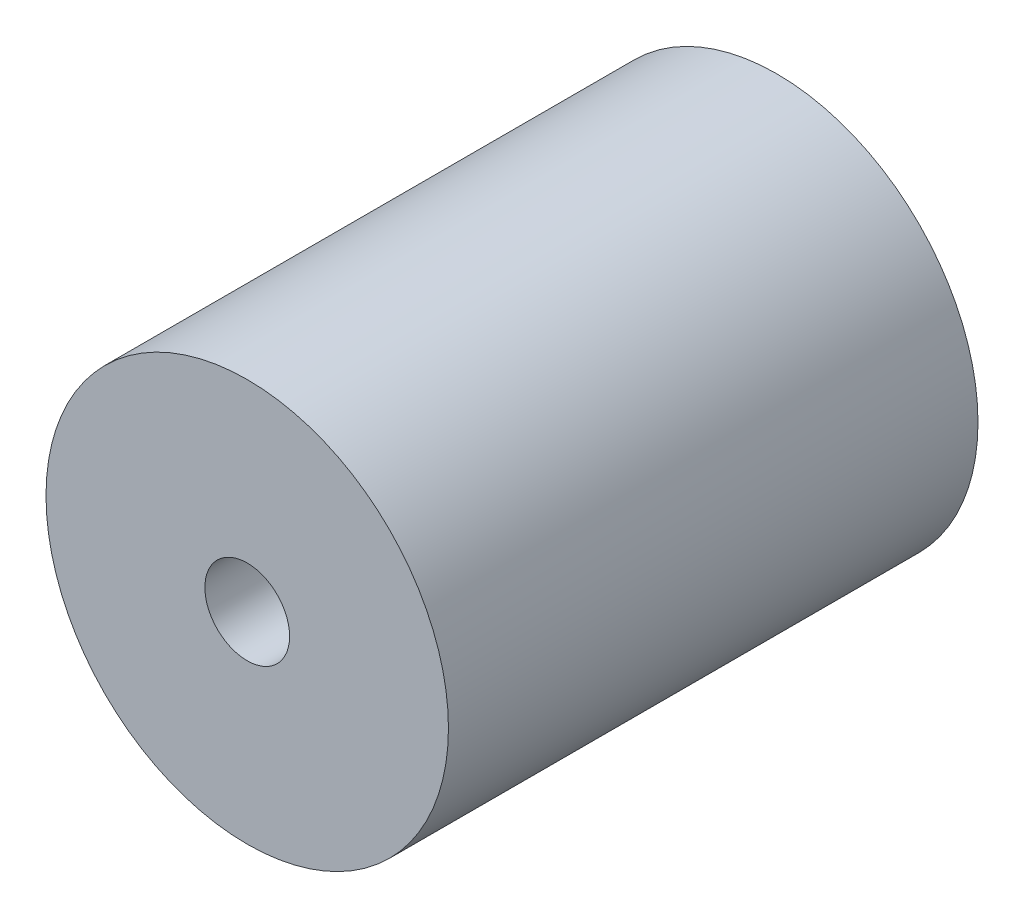
ISO-10303-21;
HEADER;
FILE_DESCRIPTION(('STEP AP214'),'2;1');
FILE_NAME('part.step','',(''),(''),'','','');
FILE_SCHEMA(('AUTOMOTIVE_DESIGN { 1 0 10303 214 1 1 1 1 }'));
ENDSEC;
DATA;
#1=APPLICATION_CONTEXT('core data for automotive mechanical design processes');
#2=APPLICATION_PROTOCOL_DEFINITION('international standard','automotive_design',2000,#1);
#3=PRODUCT_CONTEXT('',#1,'mechanical');
#4=PRODUCT('Part','Part','',(#3));
#5=PRODUCT_RELATED_PRODUCT_CATEGORY('part','',(#4));
#6=PRODUCT_DEFINITION_FORMATION('','',#4);
#7=PRODUCT_DEFINITION_CONTEXT('part definition',#1,'design');
#8=PRODUCT_DEFINITION('design','',#6,#7);
#9=PRODUCT_DEFINITION_SHAPE('','',#8);
#10=(LENGTH_UNIT() NAMED_UNIT(*) SI_UNIT(.MILLI.,.METRE.));
#11=(NAMED_UNIT(*) PLANE_ANGLE_UNIT() SI_UNIT($,.RADIAN.));
#12=(NAMED_UNIT(*) SI_UNIT($,.STERADIAN.) SOLID_ANGLE_UNIT());
#13=UNCERTAINTY_MEASURE_WITH_UNIT(LENGTH_MEASURE(1.E-05),#10,'distance_accuracy_value','');
#14=(GEOMETRIC_REPRESENTATION_CONTEXT(3) GLOBAL_UNCERTAINTY_ASSIGNED_CONTEXT((#13)) GLOBAL_UNIT_ASSIGNED_CONTEXT((#10,
#11,#12)) REPRESENTATION_CONTEXT('',''));
#15=CARTESIAN_POINT('',(0.,0.,0.));
#16=DIRECTION('',(0.,0.,1.));
#17=DIRECTION('',(1.,0.,0.));
#18=AXIS2_PLACEMENT_3D('',#15,#16,#17);
#19=CARTESIAN_POINT('',(0.,0.,0.));
#20=DIRECTION('',(0.,0.,1.));
#21=DIRECTION('',(1.,0.,0.));
#22=AXIS2_PLACEMENT_3D('',#19,#20,#21);
#23=CYLINDRICAL_SURFACE('',#22,2.);
#24=CARTESIAN_POINT('',(0.,0.,25.));
#25=DIRECTION('',(0.,0.,1.));
#26=DIRECTION('',(1.,0.,0.));
#27=AXIS2_PLACEMENT_3D('',#24,#25,#26);
#28=CIRCLE('',#27,2.);
#29=CARTESIAN_POINT('',(2.,0.,25.));
#30=VERTEX_POINT('',#29);
#31=EDGE_CURVE('E52',#30,#30,#28,.T.);
#32=ORIENTED_EDGE('',*,*,#31,.T.);
#33=EDGE_LOOP('',(#32));
#34=FACE_BOUND('',#33,.T.);
#35=CARTESIAN_POINT('',(0.,0.,12.5));
#36=DIRECTION('',(0.,0.,-1.));
#37=DIRECTION('',(-1.,0.,0.));
#38=AXIS2_PLACEMENT_3D('',#35,#36,#37);
#39=CIRCLE('',#38,2.);
#40=CARTESIAN_POINT('',(-2.,0.,12.5));
#41=VERTEX_POINT('',#40);
#42=EDGE_CURVE('E41',#41,#41,#39,.F.);
#43=ORIENTED_EDGE('',*,*,#42,.F.);
#44=EDGE_LOOP('',(#43));
#45=FACE_BOUND('',#44,.T.);
#46=ADVANCED_FACE('F37',(#34,#45),#23,.F.);
#47=CARTESIAN_POINT('',(0.,0.,25.));
#48=DIRECTION('',(0.,0.,-1.));
#49=DIRECTION('',(-1.,0.,0.));
#50=AXIS2_PLACEMENT_3D('',#47,#48,#49);
#51=CYLINDRICAL_SURFACE('',#50,9.5);
#52=CARTESIAN_POINT('',(0.,0.,25.));
#53=DIRECTION('',(0.,0.,1.));
#54=DIRECTION('',(1.,0.,0.));
#55=AXIS2_PLACEMENT_3D('',#52,#53,#54);
#56=CIRCLE('',#55,9.5);
#57=CARTESIAN_POINT('',(9.5,0.,25.));
#58=VERTEX_POINT('',#57);
#59=EDGE_CURVE('E10',#58,#58,#56,.T.);
#60=ORIENTED_EDGE('',*,*,#59,.F.);
#61=EDGE_LOOP('',(#60));
#62=FACE_BOUND('',#61,.T.);
#63=CARTESIAN_POINT('',(0.,0.,0.));
#64=DIRECTION('',(0.,0.,1.));
#65=DIRECTION('',(1.,0.,0.));
#66=AXIS2_PLACEMENT_3D('',#63,#64,#65);
#67=CIRCLE('',#66,9.5);
#68=CARTESIAN_POINT('',(9.5,0.,0.));
#69=VERTEX_POINT('',#68);
#70=EDGE_CURVE('E46',#69,#69,#67,.T.);
#71=ORIENTED_EDGE('',*,*,#70,.T.);
#72=EDGE_LOOP('',(#71));
#73=FACE_BOUND('',#72,.T.);
#74=ADVANCED_FACE('F39',(#62,#73),#51,.T.);
#75=CARTESIAN_POINT('',(0.,0.,25.));
#76=DIRECTION('',(0.,0.,1.));
#77=DIRECTION('',(1.,0.,0.));
#78=AXIS2_PLACEMENT_3D('',#75,#76,#77);
#79=PLANE('',#78);
#80=ORIENTED_EDGE('',*,*,#31,.F.);
#81=EDGE_LOOP('',(#80));
#82=FACE_BOUND('',#81,.T.);
#83=ORIENTED_EDGE('',*,*,#59,.T.);
#84=EDGE_LOOP('',(#83));
#85=FACE_BOUND('',#84,.T.);
#86=ADVANCED_FACE('F78',(#82,#85),#79,.T.);
#87=CARTESIAN_POINT('',(0.,0.,0.));
#88=DIRECTION('',(0.,0.,1.));
#89=DIRECTION('',(1.,0.,0.));
#90=AXIS2_PLACEMENT_3D('',#87,#88,#89);
#91=PLANE('',#90);
#92=CARTESIAN_POINT('',(0.,0.,0.));
#93=DIRECTION('',(0.,0.,-1.));
#94=DIRECTION('',(-1.,0.,0.));
#95=AXIS2_PLACEMENT_3D('',#92,#93,#94);
#96=CIRCLE('',#95,5.);
#97=CARTESIAN_POINT('',(-5.,0.,0.));
#98=VERTEX_POINT('',#97);
#99=EDGE_CURVE('E57',#98,#98,#96,.T.);
#100=ORIENTED_EDGE('',*,*,#99,.F.);
#101=EDGE_LOOP('',(#100));
#102=FACE_BOUND('',#101,.T.);
#103=ORIENTED_EDGE('',*,*,#70,.F.);
#104=EDGE_LOOP('',(#103));
#105=FACE_BOUND('',#104,.T.);
#106=ADVANCED_FACE('F85',(#102,#105),#91,.F.);
#107=CARTESIAN_POINT('',(0.,0.,12.5));
#108=DIRECTION('',(0.,0.,-1.));
#109=DIRECTION('',(-1.,0.,0.));
#110=AXIS2_PLACEMENT_3D('',#107,#108,#109);
#111=PLANE('',#110);
#112=CARTESIAN_POINT('',(0.,0.,12.5));
#113=DIRECTION('',(0.,0.,-1.));
#114=DIRECTION('',(-1.,0.,0.));
#115=AXIS2_PLACEMENT_3D('',#112,#113,#114);
#116=CIRCLE('',#115,5.);
#117=CARTESIAN_POINT('',(-5.,0.,12.5));
#118=VERTEX_POINT('',#117);
#119=EDGE_CURVE('E61',#118,#118,#116,.T.);
#120=ORIENTED_EDGE('',*,*,#119,.T.);
#121=EDGE_LOOP('',(#120));
#122=FACE_BOUND('',#121,.T.);
#123=ORIENTED_EDGE('',*,*,#42,.T.);
#124=EDGE_LOOP('',(#123));
#125=FACE_BOUND('',#124,.T.);
#126=ADVANCED_FACE('F70',(#122,#125),#111,.T.);
#127=CARTESIAN_POINT('',(0.,0.,12.5));
#128=DIRECTION('',(0.,0.,-1.));
#129=DIRECTION('',(-1.,0.,0.));
#130=AXIS2_PLACEMENT_3D('',#127,#128,#129);
#131=CYLINDRICAL_SURFACE('',#130,5.);
#132=ORIENTED_EDGE('',*,*,#119,.F.);
#133=EDGE_LOOP('',(#132));
#134=FACE_BOUND('',#133,.T.);
#135=ORIENTED_EDGE('',*,*,#99,.T.);
#136=EDGE_LOOP('',(#135));
#137=FACE_BOUND('',#136,.T.);
#138=ADVANCED_FACE('F82',(#134,#137),#131,.F.);
#139=CLOSED_SHELL('',(#46,#74,#86,#106,#126,#138));
#140=MANIFOLD_SOLID_BREP('B2',#139);
#141=ADVANCED_BREP_SHAPE_REPRESENTATION('',(#18,#140),#14);
#142=SHAPE_DEFINITION_REPRESENTATION(#9,#141);
ENDSEC;
END-ISO-10303-21;
